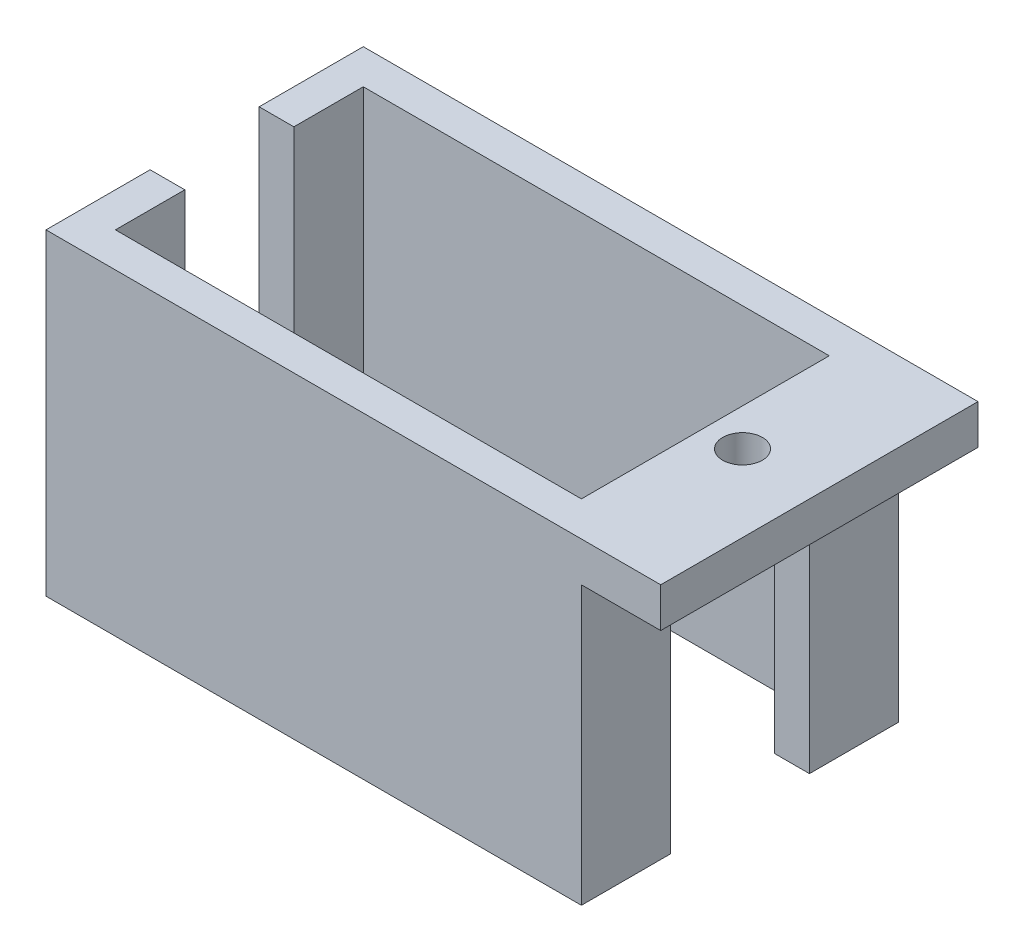
ISO-10303-21;
HEADER;
FILE_DESCRIPTION(('STEP AP214'),'2;1');
FILE_NAME('part.step','',(''),(''),'','','');
FILE_SCHEMA(('AUTOMOTIVE_DESIGN { 1 0 10303 214 1 1 1 1 }'));
ENDSEC;
DATA;
#1=APPLICATION_CONTEXT('core data for automotive mechanical design processes');
#2=APPLICATION_PROTOCOL_DEFINITION('international standard','automotive_design',2000,#1);
#3=PRODUCT_CONTEXT('',#1,'mechanical');
#4=PRODUCT('Part','Part','',(#3));
#5=PRODUCT_RELATED_PRODUCT_CATEGORY('part','',(#4));
#6=PRODUCT_DEFINITION_FORMATION('','',#4);
#7=PRODUCT_DEFINITION_CONTEXT('part definition',#1,'design');
#8=PRODUCT_DEFINITION('design','',#6,#7);
#9=PRODUCT_DEFINITION_SHAPE('','',#8);
#10=(LENGTH_UNIT() NAMED_UNIT(*) SI_UNIT(.MILLI.,.METRE.));
#11=(NAMED_UNIT(*) PLANE_ANGLE_UNIT() SI_UNIT($,.RADIAN.));
#12=(NAMED_UNIT(*) SI_UNIT($,.STERADIAN.) SOLID_ANGLE_UNIT());
#13=UNCERTAINTY_MEASURE_WITH_UNIT(LENGTH_MEASURE(1.E-05),#10,'distance_accuracy_value','');
#14=(GEOMETRIC_REPRESENTATION_CONTEXT(3) GLOBAL_UNCERTAINTY_ASSIGNED_CONTEXT((#13)) GLOBAL_UNIT_ASSIGNED_CONTEXT((#10,
#11,#12)) REPRESENTATION_CONTEXT('',''));
#15=CARTESIAN_POINT('',(0.,0.,0.));
#16=DIRECTION('',(0.,0.,1.));
#17=DIRECTION('',(1.,0.,0.));
#18=AXIS2_PLACEMENT_3D('',#15,#16,#17);
#19=CARTESIAN_POINT('',(13.5,16.,8.));
#20=DIRECTION('',(-1.,0.,0.));
#21=DIRECTION('',(0.,0.,1.));
#22=AXIS2_PLACEMENT_3D('',#19,#20,#21);
#23=PLANE('',#22);
#24=DIRECTION('',(0.,0.,-1.));
#25=VECTOR('',#24,1.);
#26=CARTESIAN_POINT('',(13.5,0.,8.));
#27=LINE('',#26,#25);
#28=CARTESIAN_POINT('',(13.5,0.,8.));
#29=VERTEX_POINT('',#28);
#30=CARTESIAN_POINT('',(13.5,0.,3.5));
#31=VERTEX_POINT('',#30);
#32=EDGE_CURVE('E265',#29,#31,#27,.T.);
#33=ORIENTED_EDGE('',*,*,#32,.T.);
#34=DIRECTION('',(0.,-1.,0.));
#35=VECTOR('',#34,1.);
#36=CARTESIAN_POINT('',(13.5,14.,3.5));
#37=LINE('',#36,#35);
#38=CARTESIAN_POINT('',(13.5,14.,3.5));
#39=VERTEX_POINT('',#38);
#40=EDGE_CURVE('E171',#39,#31,#37,.T.);
#41=ORIENTED_EDGE('',*,*,#40,.F.);
#42=DIRECTION('',(0.,0.,-1.));
#43=VECTOR('',#42,1.);
#44=CARTESIAN_POINT('',(13.5,14.,8.));
#45=LINE('',#44,#43);
#46=CARTESIAN_POINT('',(13.5,14.,8.));
#47=VERTEX_POINT('',#46);
#48=EDGE_CURVE('E48',#47,#39,#45,.T.);
#49=ORIENTED_EDGE('',*,*,#48,.F.);
#50=DIRECTION('',(0.,-1.,0.));
#51=VECTOR('',#50,1.);
#52=CARTESIAN_POINT('',(13.5,16.,8.));
#53=LINE('',#52,#51);
#54=EDGE_CURVE('E273',#47,#29,#53,.T.);
#55=ORIENTED_EDGE('',*,*,#54,.T.);
#56=EDGE_LOOP('',(#33,#41,#49,#55));
#57=FACE_BOUND('',#56,.T.);
#58=ADVANCED_FACE('F33',(#57),#23,.F.);
#59=CARTESIAN_POINT('',(13.5,14.,-3.5));
#60=VERTEX_POINT('',#59);
#61=CARTESIAN_POINT('',(13.5,14.,-8.));
#62=VERTEX_POINT('',#61);
#63=EDGE_CURVE('E164',#60,#62,#45,.T.);
#64=ORIENTED_EDGE('',*,*,#63,.F.);
#65=DIRECTION('',(0.,1.,0.));
#66=VECTOR('',#65,1.);
#67=CARTESIAN_POINT('',(13.5,14.,-3.5));
#68=LINE('',#67,#66);
#69=CARTESIAN_POINT('',(13.5,0.,-3.5));
#70=VERTEX_POINT('',#69);
#71=EDGE_CURVE('E174',#70,#60,#68,.T.);
#72=ORIENTED_EDGE('',*,*,#71,.F.);
#73=CARTESIAN_POINT('',(13.5,0.,-8.));
#74=VERTEX_POINT('',#73);
#75=EDGE_CURVE('E264',#70,#74,#27,.T.);
#76=ORIENTED_EDGE('',*,*,#75,.T.);
#77=DIRECTION('',(0.,-1.,0.));
#78=VECTOR('',#77,1.);
#79=CARTESIAN_POINT('',(13.5,16.,-8.));
#80=LINE('',#79,#78);
#81=EDGE_CURVE('E183',#62,#74,#80,.T.);
#82=ORIENTED_EDGE('',*,*,#81,.F.);
#83=EDGE_LOOP('',(#64,#72,#76,#82));
#84=FACE_BOUND('',#83,.T.);
#85=ADVANCED_FACE('F181',(#84),#23,.F.);
#86=CARTESIAN_POINT('',(-13.5,16.,8.));
#87=DIRECTION('',(1.,0.,0.));
#88=DIRECTION('',(0.,0.,-1.));
#89=AXIS2_PLACEMENT_3D('',#86,#87,#88);
#90=PLANE('',#89);
#91=DIRECTION('',(0.,0.,1.));
#92=VECTOR('',#91,1.);
#93=CARTESIAN_POINT('',(-13.5,3.,-2.75));
#94=LINE('',#93,#92);
#95=CARTESIAN_POINT('',(-13.5,3.,-2.75));
#96=VERTEX_POINT('',#95);
#97=CARTESIAN_POINT('',(-13.5,3.,2.75));
#98=VERTEX_POINT('',#97);
#99=EDGE_CURVE('E202',#96,#98,#94,.T.);
#100=ORIENTED_EDGE('',*,*,#99,.F.);
#101=DIRECTION('',(0.,-1.,0.));
#102=VECTOR('',#101,1.);
#103=CARTESIAN_POINT('',(-13.5,16.,-2.75));
#104=LINE('',#103,#102);
#105=CARTESIAN_POINT('',(-13.5,16.,-2.75));
#106=VERTEX_POINT('',#105);
#107=EDGE_CURVE('E199',#106,#96,#104,.T.);
#108=ORIENTED_EDGE('',*,*,#107,.F.);
#109=DIRECTION('',(0.,0.,1.));
#110=VECTOR('',#109,1.);
#111=CARTESIAN_POINT('',(-13.5,16.,8.));
#112=LINE('',#111,#110);
#113=CARTESIAN_POINT('',(-13.5,16.,-8.));
#114=VERTEX_POINT('',#113);
#115=EDGE_CURVE('E250',#114,#106,#112,.T.);
#116=ORIENTED_EDGE('',*,*,#115,.F.);
#117=DIRECTION('',(0.,-1.,0.));
#118=VECTOR('',#117,1.);
#119=CARTESIAN_POINT('',(-13.5,16.,-8.));
#120=LINE('',#119,#118);
#121=CARTESIAN_POINT('',(-13.5,0.,-8.));
#122=VERTEX_POINT('',#121);
#123=EDGE_CURVE('E258',#114,#122,#120,.T.);
#124=ORIENTED_EDGE('',*,*,#123,.T.);
#125=DIRECTION('',(0.,0.,1.));
#126=VECTOR('',#125,1.);
#127=CARTESIAN_POINT('',(-13.5,0.,8.));
#128=LINE('',#127,#126);
#129=CARTESIAN_POINT('',(-13.5,0.,8.));
#130=VERTEX_POINT('',#129);
#131=EDGE_CURVE('E243',#122,#130,#128,.T.);
#132=ORIENTED_EDGE('',*,*,#131,.T.);
#133=DIRECTION('',(0.,-1.,0.));
#134=VECTOR('',#133,1.);
#135=CARTESIAN_POINT('',(-13.5,16.,8.));
#136=LINE('',#135,#134);
#137=CARTESIAN_POINT('',(-13.5,16.,8.));
#138=VERTEX_POINT('',#137);
#139=EDGE_CURVE('E275',#138,#130,#136,.T.);
#140=ORIENTED_EDGE('',*,*,#139,.F.);
#141=CARTESIAN_POINT('',(-13.5,16.,2.75));
#142=VERTEX_POINT('',#141);
#143=EDGE_CURVE('E254',#142,#138,#112,.T.);
#144=ORIENTED_EDGE('',*,*,#143,.F.);
#145=DIRECTION('',(0.,1.,0.));
#146=VECTOR('',#145,1.);
#147=CARTESIAN_POINT('',(-13.5,16.,2.75));
#148=LINE('',#147,#146);
#149=EDGE_CURVE('E204',#98,#142,#148,.T.);
#150=ORIENTED_EDGE('',*,*,#149,.F.);
#151=EDGE_LOOP('',(#100,#108,#116,#124,#132,#140,#144,#150));
#152=FACE_BOUND('',#151,.T.);
#153=ADVANCED_FACE('F35',(#152),#90,.F.);
#154=CARTESIAN_POINT('',(13.5,16.,8.));
#155=DIRECTION('',(0.,0.,-1.));
#156=DIRECTION('',(-1.,0.,0.));
#157=AXIS2_PLACEMENT_3D('',#154,#155,#156);
#158=PLANE('',#157);
#159=DIRECTION('',(1.,0.,0.));
#160=VECTOR('',#159,1.);
#161=CARTESIAN_POINT('',(13.5,0.,8.));
#162=LINE('',#161,#160);
#163=EDGE_CURVE('E261',#130,#29,#162,.T.);
#164=ORIENTED_EDGE('',*,*,#163,.T.);
#165=ORIENTED_EDGE('',*,*,#54,.F.);
#166=DIRECTION('',(-1.,0.,0.));
#167=VECTOR('',#166,1.);
#168=CARTESIAN_POINT('',(17.5,14.,8.));
#169=LINE('',#168,#167);
#170=CARTESIAN_POINT('',(17.5,14.,8.));
#171=VERTEX_POINT('',#170);
#172=EDGE_CURVE('E196',#171,#47,#169,.T.);
#173=ORIENTED_EDGE('',*,*,#172,.F.);
#174=DIRECTION('',(0.,-1.,0.));
#175=VECTOR('',#174,1.);
#176=CARTESIAN_POINT('',(17.5,16.,8.));
#177=LINE('',#176,#175);
#178=CARTESIAN_POINT('',(17.5,16.,8.));
#179=VERTEX_POINT('',#178);
#180=EDGE_CURVE('E187',#179,#171,#177,.T.);
#181=ORIENTED_EDGE('',*,*,#180,.F.);
#182=DIRECTION('',(1.,0.,0.));
#183=VECTOR('',#182,1.);
#184=CARTESIAN_POINT('',(13.5,16.,8.));
#185=LINE('',#184,#183);
#186=EDGE_CURVE('E253',#138,#179,#185,.T.);
#187=ORIENTED_EDGE('',*,*,#186,.F.);
#188=ORIENTED_EDGE('',*,*,#139,.T.);
#189=EDGE_LOOP('',(#164,#165,#173,#181,#187,#188));
#190=FACE_BOUND('',#189,.T.);
#191=ADVANCED_FACE('F336',(#190),#158,.F.);
#192=CARTESIAN_POINT('',(13.5,16.,-8.));
#193=DIRECTION('',(0.,0.,1.));
#194=DIRECTION('',(1.,0.,0.));
#195=AXIS2_PLACEMENT_3D('',#192,#193,#194);
#196=PLANE('',#195);
#197=DIRECTION('',(-1.,0.,0.));
#198=VECTOR('',#197,1.);
#199=CARTESIAN_POINT('',(13.5,0.,-8.));
#200=LINE('',#199,#198);
#201=EDGE_CURVE('E268',#74,#122,#200,.T.);
#202=ORIENTED_EDGE('',*,*,#201,.T.);
#203=ORIENTED_EDGE('',*,*,#123,.F.);
#204=DIRECTION('',(-1.,0.,0.));
#205=VECTOR('',#204,1.);
#206=CARTESIAN_POINT('',(13.5,16.,-8.));
#207=LINE('',#206,#205);
#208=CARTESIAN_POINT('',(17.5,16.,-8.));
#209=VERTEX_POINT('',#208);
#210=EDGE_CURVE('E256',#209,#114,#207,.T.);
#211=ORIENTED_EDGE('',*,*,#210,.F.);
#212=DIRECTION('',(0.,1.,0.));
#213=VECTOR('',#212,1.);
#214=CARTESIAN_POINT('',(17.5,16.,-8.));
#215=LINE('',#214,#213);
#216=CARTESIAN_POINT('',(17.5,14.,-8.));
#217=VERTEX_POINT('',#216);
#218=EDGE_CURVE('E325',#217,#209,#215,.T.);
#219=ORIENTED_EDGE('',*,*,#218,.F.);
#220=DIRECTION('',(-1.,0.,0.));
#221=VECTOR('',#220,1.);
#222=CARTESIAN_POINT('',(17.5,14.,-8.));
#223=LINE('',#222,#221);
#224=EDGE_CURVE('E194',#217,#62,#223,.T.);
#225=ORIENTED_EDGE('',*,*,#224,.T.);
#226=ORIENTED_EDGE('',*,*,#81,.T.);
#227=EDGE_LOOP('',(#202,#203,#211,#219,#225,#226));
#228=FACE_BOUND('',#227,.T.);
#229=ADVANCED_FACE('F339',(#228),#196,.F.);
#230=CARTESIAN_POINT('',(0.,16.,0.));
#231=DIRECTION('',(0.,1.,0.));
#232=DIRECTION('',(0.,0.,1.));
#233=AXIS2_PLACEMENT_3D('',#230,#231,#232);
#234=PLANE('',#233);
#235=CARTESIAN_POINT('',(13.625,16.,0.));
#236=DIRECTION('',(0.,1.,0.));
#237=DIRECTION('',(0.,0.,1.));
#238=AXIS2_PLACEMENT_3D('',#235,#236,#237);
#239=CIRCLE('',#238,1.);
#240=CARTESIAN_POINT('',(13.625,16.,1.));
#241=VERTEX_POINT('',#240);
#242=EDGE_CURVE('E185',#241,#241,#239,.T.);
#243=ORIENTED_EDGE('',*,*,#242,.F.);
#244=EDGE_LOOP('',(#243));
#245=FACE_BOUND('',#244,.T.);
#246=DIRECTION('',(-1.,0.,0.));
#247=VECTOR('',#246,1.);
#248=CARTESIAN_POINT('',(-9.5,16.,-2.75));
#249=LINE('',#248,#247);
#250=CARTESIAN_POINT('',(-11.75,16.,-2.75));
#251=VERTEX_POINT('',#250);
#252=EDGE_CURVE('E207',#251,#106,#249,.T.);
#253=ORIENTED_EDGE('',*,*,#252,.F.);
#254=DIRECTION('',(0.,0.,1.));
#255=VECTOR('',#254,1.);
#256=CARTESIAN_POINT('',(-11.75,16.,6.25));
#257=LINE('',#256,#255);
#258=CARTESIAN_POINT('',(-11.75,16.,-6.25));
#259=VERTEX_POINT('',#258);
#260=EDGE_CURVE('E230',#259,#251,#257,.T.);
#261=ORIENTED_EDGE('',*,*,#260,.F.);
#262=DIRECTION('',(-1.,0.,0.));
#263=VECTOR('',#262,1.);
#264=CARTESIAN_POINT('',(11.75,16.,-6.25));
#265=LINE('',#264,#263);
#266=CARTESIAN_POINT('',(11.75,16.,-6.25));
#267=VERTEX_POINT('',#266);
#268=EDGE_CURVE('E219',#267,#259,#265,.T.);
#269=ORIENTED_EDGE('',*,*,#268,.F.);
#270=DIRECTION('',(0.,0.,-1.));
#271=VECTOR('',#270,1.);
#272=CARTESIAN_POINT('',(11.75,16.,6.25));
#273=LINE('',#272,#271);
#274=CARTESIAN_POINT('',(11.75,16.,6.25));
#275=VERTEX_POINT('',#274);
#276=EDGE_CURVE('E236',#275,#267,#273,.T.);
#277=ORIENTED_EDGE('',*,*,#276,.F.);
#278=DIRECTION('',(1.,0.,0.));
#279=VECTOR('',#278,1.);
#280=CARTESIAN_POINT('',(11.75,16.,6.25));
#281=LINE('',#280,#279);
#282=CARTESIAN_POINT('',(-11.75,16.,6.25));
#283=VERTEX_POINT('',#282);
#284=EDGE_CURVE('E233',#283,#275,#281,.T.);
#285=ORIENTED_EDGE('',*,*,#284,.F.);
#286=CARTESIAN_POINT('',(-11.75,16.,2.75));
#287=VERTEX_POINT('',#286);
#288=EDGE_CURVE('E209',#287,#283,#257,.T.);
#289=ORIENTED_EDGE('',*,*,#288,.F.);
#290=DIRECTION('',(-1.,0.,0.));
#291=VECTOR('',#290,1.);
#292=CARTESIAN_POINT('',(-9.5,16.,2.75));
#293=LINE('',#292,#291);
#294=EDGE_CURVE('E210',#287,#142,#293,.T.);
#295=ORIENTED_EDGE('',*,*,#294,.T.);
#296=ORIENTED_EDGE('',*,*,#143,.T.);
#297=ORIENTED_EDGE('',*,*,#186,.T.);
#298=DIRECTION('',(0.,0.,1.));
#299=VECTOR('',#298,1.);
#300=CARTESIAN_POINT('',(17.5,16.,8.));
#301=LINE('',#300,#299);
#302=EDGE_CURVE('E192',#209,#179,#301,.T.);
#303=ORIENTED_EDGE('',*,*,#302,.F.);
#304=ORIENTED_EDGE('',*,*,#210,.T.);
#305=ORIENTED_EDGE('',*,*,#115,.T.);
#306=EDGE_LOOP('',(#253,#261,#269,#277,#285,#289,#295,#296,#297,#303,#304,#305));
#307=FACE_BOUND('',#306,.T.);
#308=ADVANCED_FACE('F312',(#245,#307),#234,.T.);
#309=CARTESIAN_POINT('',(0.,0.,0.));
#310=DIRECTION('',(0.,1.,0.));
#311=DIRECTION('',(0.,0.,1.));
#312=AXIS2_PLACEMENT_3D('',#309,#310,#311);
#313=PLANE('',#312);
#314=ORIENTED_EDGE('',*,*,#75,.F.);
#315=DIRECTION('',(1.,0.,0.));
#316=VECTOR('',#315,1.);
#317=CARTESIAN_POINT('',(9.5,0.,-3.5));
#318=LINE('',#317,#316);
#319=CARTESIAN_POINT('',(11.75,0.,-3.5));
#320=VERTEX_POINT('',#319);
#321=EDGE_CURVE('E177',#320,#70,#318,.T.);
#322=ORIENTED_EDGE('',*,*,#321,.F.);
#323=DIRECTION('',(0.,0.,-1.));
#324=VECTOR('',#323,1.);
#325=CARTESIAN_POINT('',(11.75,0.,6.25));
#326=LINE('',#325,#324);
#327=CARTESIAN_POINT('',(11.75,0.,-6.25));
#328=VERTEX_POINT('',#327);
#329=EDGE_CURVE('E222',#320,#328,#326,.T.);
#330=ORIENTED_EDGE('',*,*,#329,.T.);
#331=DIRECTION('',(-1.,0.,0.));
#332=VECTOR('',#331,1.);
#333=CARTESIAN_POINT('',(11.75,0.,-6.25));
#334=LINE('',#333,#332);
#335=CARTESIAN_POINT('',(-11.75,0.,-6.25));
#336=VERTEX_POINT('',#335);
#337=EDGE_CURVE('E226',#328,#336,#334,.T.);
#338=ORIENTED_EDGE('',*,*,#337,.T.);
#339=DIRECTION('',(0.,0.,1.));
#340=VECTOR('',#339,1.);
#341=CARTESIAN_POINT('',(-11.75,0.,6.25));
#342=LINE('',#341,#340);
#343=CARTESIAN_POINT('',(-11.75,0.,6.25));
#344=VERTEX_POINT('',#343);
#345=EDGE_CURVE('E215',#336,#344,#342,.T.);
#346=ORIENTED_EDGE('',*,*,#345,.T.);
#347=DIRECTION('',(1.,0.,0.));
#348=VECTOR('',#347,1.);
#349=CARTESIAN_POINT('',(11.75,0.,6.25));
#350=LINE('',#349,#348);
#351=CARTESIAN_POINT('',(11.75,0.,6.25));
#352=VERTEX_POINT('',#351);
#353=EDGE_CURVE('E218',#344,#352,#350,.T.);
#354=ORIENTED_EDGE('',*,*,#353,.T.);
#355=CARTESIAN_POINT('',(11.75,0.,3.5));
#356=VERTEX_POINT('',#355);
#357=EDGE_CURVE('E223',#352,#356,#326,.T.);
#358=ORIENTED_EDGE('',*,*,#357,.T.);
#359=DIRECTION('',(1.,0.,0.));
#360=VECTOR('',#359,1.);
#361=CARTESIAN_POINT('',(9.5,0.,3.5));
#362=LINE('',#361,#360);
#363=EDGE_CURVE('E299',#356,#31,#362,.T.);
#364=ORIENTED_EDGE('',*,*,#363,.T.);
#365=ORIENTED_EDGE('',*,*,#32,.F.);
#366=ORIENTED_EDGE('',*,*,#163,.F.);
#367=ORIENTED_EDGE('',*,*,#131,.F.);
#368=ORIENTED_EDGE('',*,*,#201,.F.);
#369=EDGE_LOOP('',(#314,#322,#330,#338,#346,#354,#358,#364,#365,#366,#367,#368));
#370=FACE_BOUND('',#369,.T.);
#371=ADVANCED_FACE('F297',(#370),#313,.F.);
#372=CARTESIAN_POINT('',(-11.75,0.,6.25));
#373=DIRECTION('',(-1.,0.,0.));
#374=DIRECTION('',(0.,0.,1.));
#375=AXIS2_PLACEMENT_3D('',#372,#373,#374);
#376=PLANE('',#375);
#377=ORIENTED_EDGE('',*,*,#260,.T.);
#378=DIRECTION('',(0.,-1.,0.));
#379=VECTOR('',#378,1.);
#380=CARTESIAN_POINT('',(-11.75,0.,-2.75));
#381=LINE('',#380,#379);
#382=CARTESIAN_POINT('',(-11.75,3.,-2.75));
#383=VERTEX_POINT('',#382);
#384=EDGE_CURVE('E284',#251,#383,#381,.T.);
#385=ORIENTED_EDGE('',*,*,#384,.T.);
#386=DIRECTION('',(0.,0.,1.));
#387=VECTOR('',#386,1.);
#388=CARTESIAN_POINT('',(-11.75,3.,6.25));
#389=LINE('',#388,#387);
#390=CARTESIAN_POINT('',(-11.75,3.,2.75));
#391=VERTEX_POINT('',#390);
#392=EDGE_CURVE('E278',#383,#391,#389,.T.);
#393=ORIENTED_EDGE('',*,*,#392,.T.);
#394=DIRECTION('',(0.,1.,0.));
#395=VECTOR('',#394,1.);
#396=CARTESIAN_POINT('',(-11.75,0.,2.75));
#397=LINE('',#396,#395);
#398=EDGE_CURVE('E281',#391,#287,#397,.T.);
#399=ORIENTED_EDGE('',*,*,#398,.T.);
#400=ORIENTED_EDGE('',*,*,#288,.T.);
#401=DIRECTION('',(0.,1.,0.));
#402=VECTOR('',#401,1.);
#403=CARTESIAN_POINT('',(-11.75,0.,6.25));
#404=LINE('',#403,#402);
#405=EDGE_CURVE('E229',#344,#283,#404,.T.);
#406=ORIENTED_EDGE('',*,*,#405,.F.);
#407=ORIENTED_EDGE('',*,*,#345,.F.);
#408=DIRECTION('',(0.,1.,0.));
#409=VECTOR('',#408,1.);
#410=CARTESIAN_POINT('',(-11.75,0.,-6.25));
#411=LINE('',#410,#409);
#412=EDGE_CURVE('E241',#336,#259,#411,.T.);
#413=ORIENTED_EDGE('',*,*,#412,.T.);
#414=EDGE_LOOP('',(#377,#385,#393,#399,#400,#406,#407,#413));
#415=FACE_BOUND('',#414,.T.);
#416=ADVANCED_FACE('F351',(#415),#376,.F.);
#417=CARTESIAN_POINT('',(11.75,0.,-6.25));
#418=DIRECTION('',(0.,0.,-1.));
#419=DIRECTION('',(-1.,0.,0.));
#420=AXIS2_PLACEMENT_3D('',#417,#418,#419);
#421=PLANE('',#420);
#422=ORIENTED_EDGE('',*,*,#268,.T.);
#423=ORIENTED_EDGE('',*,*,#412,.F.);
#424=ORIENTED_EDGE('',*,*,#337,.F.);
#425=DIRECTION('',(0.,1.,0.));
#426=VECTOR('',#425,1.);
#427=CARTESIAN_POINT('',(11.75,0.,-6.25));
#428=LINE('',#427,#426);
#429=EDGE_CURVE('E244',#328,#267,#428,.T.);
#430=ORIENTED_EDGE('',*,*,#429,.T.);
#431=EDGE_LOOP('',(#422,#423,#424,#430));
#432=FACE_BOUND('',#431,.T.);
#433=ADVANCED_FACE('F314',(#432),#421,.F.);
#434=CARTESIAN_POINT('',(11.75,0.,6.25));
#435=DIRECTION('',(1.,0.,0.));
#436=DIRECTION('',(0.,0.,-1.));
#437=AXIS2_PLACEMENT_3D('',#434,#435,#436);
#438=PLANE('',#437);
#439=ORIENTED_EDGE('',*,*,#329,.F.);
#440=DIRECTION('',(0.,1.,0.));
#441=VECTOR('',#440,1.);
#442=CARTESIAN_POINT('',(11.75,0.,-3.5));
#443=LINE('',#442,#441);
#444=CARTESIAN_POINT('',(11.75,14.,-3.5));
#445=VERTEX_POINT('',#444);
#446=EDGE_CURVE('E11',#320,#445,#443,.T.);
#447=ORIENTED_EDGE('',*,*,#446,.T.);
#448=DIRECTION('',(0.,0.,1.));
#449=VECTOR('',#448,1.);
#450=CARTESIAN_POINT('',(11.75,14.,6.25));
#451=LINE('',#450,#449);
#452=CARTESIAN_POINT('',(11.75,14.,3.5));
#453=VERTEX_POINT('',#452);
#454=EDGE_CURVE('E168',#445,#453,#451,.T.);
#455=ORIENTED_EDGE('',*,*,#454,.T.);
#456=DIRECTION('',(0.,-1.,0.));
#457=VECTOR('',#456,1.);
#458=CARTESIAN_POINT('',(11.75,0.,3.5));
#459=LINE('',#458,#457);
#460=EDGE_CURVE('E41',#453,#356,#459,.T.);
#461=ORIENTED_EDGE('',*,*,#460,.T.);
#462=ORIENTED_EDGE('',*,*,#357,.F.);
#463=DIRECTION('',(0.,1.,0.));
#464=VECTOR('',#463,1.);
#465=CARTESIAN_POINT('',(11.75,0.,6.25));
#466=LINE('',#465,#464);
#467=EDGE_CURVE('E246',#352,#275,#466,.T.);
#468=ORIENTED_EDGE('',*,*,#467,.T.);
#469=ORIENTED_EDGE('',*,*,#276,.T.);
#470=ORIENTED_EDGE('',*,*,#429,.F.);
#471=EDGE_LOOP('',(#439,#447,#455,#461,#462,#468,#469,#470));
#472=FACE_BOUND('',#471,.T.);
#473=ADVANCED_FACE('F292',(#472),#438,.F.);
#474=CARTESIAN_POINT('',(11.75,0.,6.25));
#475=DIRECTION('',(0.,0.,1.));
#476=DIRECTION('',(1.,0.,0.));
#477=AXIS2_PLACEMENT_3D('',#474,#475,#476);
#478=PLANE('',#477);
#479=ORIENTED_EDGE('',*,*,#284,.T.);
#480=ORIENTED_EDGE('',*,*,#467,.F.);
#481=ORIENTED_EDGE('',*,*,#353,.F.);
#482=ORIENTED_EDGE('',*,*,#405,.T.);
#483=EDGE_LOOP('',(#479,#480,#481,#482));
#484=FACE_BOUND('',#483,.T.);
#485=ADVANCED_FACE('F303',(#484),#478,.F.);
#486=CARTESIAN_POINT('',(-9.5,16.,-2.75));
#487=DIRECTION('',(0.,0.,-1.));
#488=DIRECTION('',(-1.,0.,0.));
#489=AXIS2_PLACEMENT_3D('',#486,#487,#488);
#490=PLANE('',#489);
#491=ORIENTED_EDGE('',*,*,#252,.T.);
#492=ORIENTED_EDGE('',*,*,#107,.T.);
#493=DIRECTION('',(-1.,0.,0.));
#494=VECTOR('',#493,1.);
#495=CARTESIAN_POINT('',(-9.5,3.,-2.75));
#496=LINE('',#495,#494);
#497=EDGE_CURVE('E206',#383,#96,#496,.T.);
#498=ORIENTED_EDGE('',*,*,#497,.F.);
#499=ORIENTED_EDGE('',*,*,#384,.F.);
#500=EDGE_LOOP('',(#491,#492,#498,#499));
#501=FACE_BOUND('',#500,.T.);
#502=ADVANCED_FACE('F349',(#501),#490,.F.);
#503=CARTESIAN_POINT('',(-9.5,16.,2.75));
#504=DIRECTION('',(0.,0.,1.));
#505=DIRECTION('',(0.,-1.,0.));
#506=AXIS2_PLACEMENT_3D('',#503,#504,#505);
#507=PLANE('',#506);
#508=DIRECTION('',(-1.,0.,0.));
#509=VECTOR('',#508,1.);
#510=CARTESIAN_POINT('',(-9.5,3.,2.75));
#511=LINE('',#510,#509);
#512=EDGE_CURVE('E56',#391,#98,#511,.T.);
#513=ORIENTED_EDGE('',*,*,#512,.T.);
#514=ORIENTED_EDGE('',*,*,#149,.T.);
#515=ORIENTED_EDGE('',*,*,#294,.F.);
#516=ORIENTED_EDGE('',*,*,#398,.F.);
#517=EDGE_LOOP('',(#513,#514,#515,#516));
#518=FACE_BOUND('',#517,.T.);
#519=ADVANCED_FACE('F482',(#518),#507,.F.);
#520=CARTESIAN_POINT('',(-9.5,3.,-2.75));
#521=DIRECTION('',(0.,-1.,0.));
#522=DIRECTION('',(0.,0.,-1.));
#523=AXIS2_PLACEMENT_3D('',#520,#521,#522);
#524=PLANE('',#523);
#525=ORIENTED_EDGE('',*,*,#497,.T.);
#526=ORIENTED_EDGE('',*,*,#99,.T.);
#527=ORIENTED_EDGE('',*,*,#512,.F.);
#528=ORIENTED_EDGE('',*,*,#392,.F.);
#529=EDGE_LOOP('',(#525,#526,#527,#528));
#530=FACE_BOUND('',#529,.T.);
#531=ADVANCED_FACE('F420',(#530),#524,.F.);
#532=CARTESIAN_POINT('',(17.5,14.,8.));
#533=DIRECTION('',(0.,1.,0.));
#534=DIRECTION('',(0.,0.,1.));
#535=AXIS2_PLACEMENT_3D('',#532,#533,#534);
#536=PLANE('',#535);
#537=DIRECTION('',(1.,0.,0.));
#538=VECTOR('',#537,1.);
#539=CARTESIAN_POINT('',(9.5,14.,-3.5));
#540=LINE('',#539,#538);
#541=EDGE_CURVE('E158',#445,#60,#540,.T.);
#542=ORIENTED_EDGE('',*,*,#541,.T.);
#543=ORIENTED_EDGE('',*,*,#63,.T.);
#544=ORIENTED_EDGE('',*,*,#224,.F.);
#545=DIRECTION('',(0.,0.,-1.));
#546=VECTOR('',#545,1.);
#547=CARTESIAN_POINT('',(17.5,14.,8.));
#548=LINE('',#547,#546);
#549=EDGE_CURVE('E324',#171,#217,#548,.T.);
#550=ORIENTED_EDGE('',*,*,#549,.F.);
#551=ORIENTED_EDGE('',*,*,#172,.T.);
#552=ORIENTED_EDGE('',*,*,#48,.T.);
#553=DIRECTION('',(1.,0.,0.));
#554=VECTOR('',#553,1.);
#555=CARTESIAN_POINT('',(9.5,14.,3.5));
#556=LINE('',#555,#554);
#557=EDGE_CURVE('E170',#453,#39,#556,.T.);
#558=ORIENTED_EDGE('',*,*,#557,.F.);
#559=ORIENTED_EDGE('',*,*,#454,.F.);
#560=EDGE_LOOP('',(#542,#543,#544,#550,#551,#552,#558,#559));
#561=FACE_BOUND('',#560,.T.);
#562=CARTESIAN_POINT('',(13.625,14.,0.));
#563=DIRECTION('',(0.,1.,0.));
#564=DIRECTION('',(0.,0.,1.));
#565=AXIS2_PLACEMENT_3D('',#562,#563,#564);
#566=CIRCLE('',#565,1.);
#567=CARTESIAN_POINT('',(13.625,14.,1.));
#568=VERTEX_POINT('',#567);
#569=EDGE_CURVE('E287',#568,#568,#566,.T.);
#570=ORIENTED_EDGE('',*,*,#569,.T.);
#571=EDGE_LOOP('',(#570));
#572=FACE_BOUND('',#571,.T.);
#573=ADVANCED_FACE('F160',(#561,#572),#536,.F.);
#574=CARTESIAN_POINT('',(17.5,0.,0.));
#575=DIRECTION('',(1.,0.,0.));
#576=DIRECTION('',(0.,0.,-1.));
#577=AXIS2_PLACEMENT_3D('',#574,#575,#576);
#578=PLANE('',#577);
#579=ORIENTED_EDGE('',*,*,#180,.T.);
#580=ORIENTED_EDGE('',*,*,#549,.T.);
#581=ORIENTED_EDGE('',*,*,#218,.T.);
#582=ORIENTED_EDGE('',*,*,#302,.T.);
#583=EDGE_LOOP('',(#579,#580,#581,#582));
#584=FACE_BOUND('',#583,.T.);
#585=ADVANCED_FACE('F332',(#584),#578,.T.);
#586=CARTESIAN_POINT('',(13.625,0.,0.));
#587=DIRECTION('',(0.,1.,0.));
#588=DIRECTION('',(0.,0.,1.));
#589=AXIS2_PLACEMENT_3D('',#586,#587,#588);
#590=CYLINDRICAL_SURFACE('',#589,1.);
#591=ORIENTED_EDGE('',*,*,#242,.T.);
#592=EDGE_LOOP('',(#591));
#593=FACE_BOUND('',#592,.T.);
#594=ORIENTED_EDGE('',*,*,#569,.F.);
#595=EDGE_LOOP('',(#594));
#596=FACE_BOUND('',#595,.T.);
#597=ADVANCED_FACE('F361',(#593,#596),#590,.F.);
#598=CARTESIAN_POINT('',(9.5,14.,-3.5));
#599=DIRECTION('',(0.,0.,-1.));
#600=DIRECTION('',(0.,1.,0.));
#601=AXIS2_PLACEMENT_3D('',#598,#599,#600);
#602=PLANE('',#601);
#603=ORIENTED_EDGE('',*,*,#321,.T.);
#604=ORIENTED_EDGE('',*,*,#71,.T.);
#605=ORIENTED_EDGE('',*,*,#541,.F.);
#606=ORIENTED_EDGE('',*,*,#446,.F.);
#607=EDGE_LOOP('',(#603,#604,#605,#606));
#608=FACE_BOUND('',#607,.T.);
#609=ADVANCED_FACE('F175',(#608),#602,.F.);
#610=CARTESIAN_POINT('',(9.5,14.,3.5));
#611=DIRECTION('',(0.,0.,1.));
#612=DIRECTION('',(0.,-1.,0.));
#613=AXIS2_PLACEMENT_3D('',#610,#611,#612);
#614=PLANE('',#613);
#615=ORIENTED_EDGE('',*,*,#557,.T.);
#616=ORIENTED_EDGE('',*,*,#40,.T.);
#617=ORIENTED_EDGE('',*,*,#363,.F.);
#618=ORIENTED_EDGE('',*,*,#460,.F.);
#619=EDGE_LOOP('',(#615,#616,#617,#618));
#620=FACE_BOUND('',#619,.T.);
#621=ADVANCED_FACE('F355',(#620),#614,.F.);
#622=CLOSED_SHELL('',(#58,#85,#153,#191,#229,#308,#371,#416,#433,#473,#485,#502,#519,#531,#573,
#585,#597,#609,#621));
#623=MANIFOLD_SOLID_BREP('B2',#622);
#624=ADVANCED_BREP_SHAPE_REPRESENTATION('',(#18,#623),#14);
#625=SHAPE_DEFINITION_REPRESENTATION(#9,#624);
ENDSEC;
END-ISO-10303-21;
